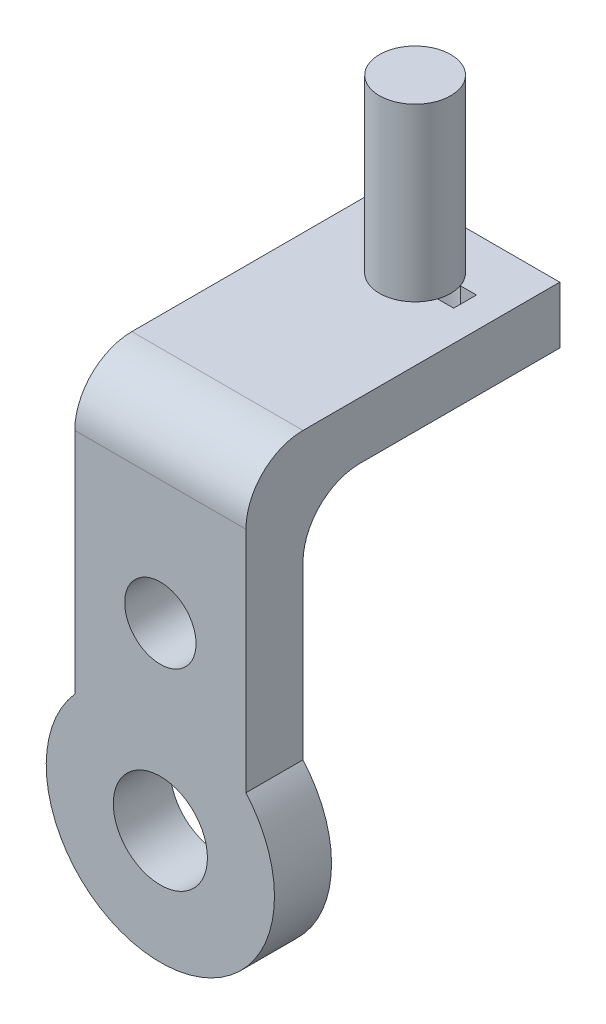
ISO-10303-21;
HEADER;
FILE_DESCRIPTION(('STEP AP214'),'2;1');
FILE_NAME('part.step','',(''),(''),'','','');
FILE_SCHEMA(('AUTOMOTIVE_DESIGN { 1 0 10303 214 1 1 1 1 }'));
ENDSEC;
DATA;
#1=APPLICATION_CONTEXT('core data for automotive mechanical design processes');
#2=APPLICATION_PROTOCOL_DEFINITION('international standard','automotive_design',2000,#1);
#3=PRODUCT_CONTEXT('',#1,'mechanical');
#4=PRODUCT('Part','Part','',(#3));
#5=PRODUCT_RELATED_PRODUCT_CATEGORY('part','',(#4));
#6=PRODUCT_DEFINITION_FORMATION('','',#4);
#7=PRODUCT_DEFINITION_CONTEXT('part definition',#1,'design');
#8=PRODUCT_DEFINITION('design','',#6,#7);
#9=PRODUCT_DEFINITION_SHAPE('','',#8);
#10=(LENGTH_UNIT() NAMED_UNIT(*) SI_UNIT(.MILLI.,.METRE.));
#11=(NAMED_UNIT(*) PLANE_ANGLE_UNIT() SI_UNIT($,.RADIAN.));
#12=(NAMED_UNIT(*) SI_UNIT($,.STERADIAN.) SOLID_ANGLE_UNIT());
#13=UNCERTAINTY_MEASURE_WITH_UNIT(LENGTH_MEASURE(1.E-05),#10,'distance_accuracy_value','');
#14=(GEOMETRIC_REPRESENTATION_CONTEXT(3) GLOBAL_UNCERTAINTY_ASSIGNED_CONTEXT((#13)) GLOBAL_UNIT_ASSIGNED_CONTEXT((#10,
#11,#12)) REPRESENTATION_CONTEXT('',''));
#15=CARTESIAN_POINT('',(0.,0.,0.));
#16=DIRECTION('',(0.,0.,1.));
#17=DIRECTION('',(1.,0.,0.));
#18=AXIS2_PLACEMENT_3D('',#15,#16,#17);
#19=CARTESIAN_POINT('',(5.06055020156282,128.019801980198,-67.5));
#20=DIRECTION('',(0.,-1.,0.));
#21=DIRECTION('',(0.,0.,-1.));
#22=AXIS2_PLACEMENT_3D('',#19,#20,#21);
#23=CYLINDRICAL_SURFACE('',#22,12.5);
#24=CARTESIAN_POINT('',(5.06055020156282,128.019801980198,-67.5));
#25=DIRECTION('',(0.,1.,0.));
#26=DIRECTION('',(0.,0.,1.));
#27=AXIS2_PLACEMENT_3D('',#24,#25,#26);
#28=CIRCLE('',#27,12.5);
#29=CARTESIAN_POINT('',(5.06055020156282,128.019801980198,-55.));
#30=VERTEX_POINT('',#29);
#31=EDGE_CURVE('E11',#30,#30,#28,.T.);
#32=ORIENTED_EDGE('',*,*,#31,.F.);
#33=EDGE_LOOP('',(#32));
#34=FACE_BOUND('',#33,.T.);
#35=CARTESIAN_POINT('',(5.06055020156282,68.0198019801981,-67.5));
#36=DIRECTION('',(0.,1.,0.));
#37=DIRECTION('',(0.,0.,1.));
#38=AXIS2_PLACEMENT_3D('',#35,#36,#37);
#39=CIRCLE('',#38,12.5);
#40=CARTESIAN_POINT('',(5.06055020156282,68.0198019801981,-55.));
#41=VERTEX_POINT('',#40);
#42=EDGE_CURVE('E44',#41,#41,#39,.T.);
#43=ORIENTED_EDGE('',*,*,#42,.T.);
#44=EDGE_LOOP('',(#43));
#45=FACE_BOUND('',#44,.T.);
#46=ADVANCED_FACE('F41',(#34,#45),#23,.T.);
#47=CARTESIAN_POINT('',(5.06055020156282,128.019801980198,-67.5));
#48=DIRECTION('',(0.,1.,0.));
#49=DIRECTION('',(0.,0.,1.));
#50=AXIS2_PLACEMENT_3D('',#47,#48,#49);
#51=PLANE('',#50);
#52=ORIENTED_EDGE('',*,*,#31,.T.);
#53=EDGE_LOOP('',(#52));
#54=FACE_BOUND('',#53,.T.);
#55=ADVANCED_FACE('F56',(#54),#51,.T.);
#56=CARTESIAN_POINT('',(5.06055020156282,68.0198019801981,-67.5));
#57=DIRECTION('',(0.,1.,0.));
#58=DIRECTION('',(0.,0.,1.));
#59=AXIS2_PLACEMENT_3D('',#56,#57,#58);
#60=PLANE('',#59);
#61=ORIENTED_EDGE('',*,*,#42,.F.);
#62=EDGE_LOOP('',(#61));
#63=FACE_BOUND('',#62,.T.);
#64=ADVANCED_FACE('F54',(#63),#60,.F.);
#65=CLOSED_SHELL('',(#46,#55,#64));
#66=MANIFOLD_SOLID_BREP('B2',#65);
#67=CARTESIAN_POINT('',(3.26732673267325,-58.4801980198019,0.));
#68=DIRECTION('',(0.,0.,1.));
#69=DIRECTION('',(1.,0.,0.));
#70=AXIS2_PLACEMENT_3D('',#67,#68,#69);
#71=PLANE('',#70);
#72=CARTESIAN_POINT('',(3.26732673267325,4.51980198019805,0.));
#73=DIRECTION('',(0.,0.,1.));
#74=DIRECTION('',(1.,0.,0.));
#75=AXIS2_PLACEMENT_3D('',#72,#73,#74);
#76=CIRCLE('',#75,12.5);
#77=CARTESIAN_POINT('',(15.7673267326732,4.51980198019805,0.));
#78=VERTEX_POINT('',#77);
#79=EDGE_CURVE('E513',#78,#78,#76,.T.);
#80=ORIENTED_EDGE('',*,*,#79,.T.);
#81=EDGE_LOOP('',(#80));
#82=FACE_BOUND('',#81,.T.);
#83=CARTESIAN_POINT('',(3.26732673267325,-58.4801980198019,0.));
#84=DIRECTION('',(0.,0.,1.));
#85=DIRECTION('',(1.,0.,0.));
#86=AXIS2_PLACEMENT_3D('',#83,#84,#85);
#87=CIRCLE('',#86,16.5);
#88=CARTESIAN_POINT('',(19.7673267326732,-58.4801980198019,0.));
#89=VERTEX_POINT('',#88);
#90=EDGE_CURVE('E228',#89,#89,#87,.T.);
#91=ORIENTED_EDGE('',*,*,#90,.T.);
#92=EDGE_LOOP('',(#91));
#93=FACE_BOUND('',#92,.T.);
#94=DIRECTION('',(0.,-1.,0.));
#95=VECTOR('',#94,1.);
#96=CARTESIAN_POINT('',(-26.7326732673268,68.0198019801981,0.));
#97=LINE('',#96,#95);
#98=CARTESIAN_POINT('',(-26.7326732673268,28.0198019801981,0.));
#99=VERTEX_POINT('',#98);
#100=CARTESIAN_POINT('',(-26.7326732673267,-31.980198019802,0.));
#101=VERTEX_POINT('',#100);
#102=EDGE_CURVE('E232',#99,#101,#97,.T.);
#103=ORIENTED_EDGE('',*,*,#102,.F.);
#104=DIRECTION('',(-1.,0.,0.));
#105=VECTOR('',#104,1.);
#106=CARTESIAN_POINT('',(33.2673267326732,28.0198019801981,0.));
#107=LINE('',#106,#105);
#108=CARTESIAN_POINT('',(33.2673267326732,28.0198019801981,0.));
#109=VERTEX_POINT('',#108);
#110=EDGE_CURVE('E284',#99,#109,#107,.F.);
#111=ORIENTED_EDGE('',*,*,#110,.T.);
#112=DIRECTION('',(0.,1.,0.));
#113=VECTOR('',#112,1.);
#114=CARTESIAN_POINT('',(33.2673267326732,68.0198019801981,0.));
#115=LINE('',#114,#113);
#116=CARTESIAN_POINT('',(33.2673267326733,-31.980198019802,0.));
#117=VERTEX_POINT('',#116);
#118=EDGE_CURVE('E238',#117,#109,#115,.T.);
#119=ORIENTED_EDGE('',*,*,#118,.F.);
#120=DIRECTION('',(1.,1.84921450168608E-13,0.));
#121=VECTOR('',#120,1.);
#122=CARTESIAN_POINT('',(33.2298032658305,-31.980198019802,0.));
#123=LINE('',#122,#121);
#124=CARTESIAN_POINT('',(33.2298032658305,-31.980198019802,0.));
#125=VERTEX_POINT('',#124);
#126=EDGE_CURVE('E253',#125,#117,#123,.T.);
#127=ORIENTED_EDGE('',*,*,#126,.F.);
#128=CARTESIAN_POINT('',(3.26732673267325,-58.4801980198019,0.));
#129=DIRECTION('',(0.,0.,1.));
#130=DIRECTION('',(1.,0.,0.));
#131=AXIS2_PLACEMENT_3D('',#128,#129,#130);
#132=CIRCLE('',#131,40.);
#133=CARTESIAN_POINT('',(-26.695149800484,-31.980198019802,0.));
#134=VERTEX_POINT('',#133);
#135=EDGE_CURVE('E251',#134,#125,#132,.T.);
#136=ORIENTED_EDGE('',*,*,#135,.F.);
#137=DIRECTION('',(1.,-1.84921450168676E-13,0.));
#138=VECTOR('',#137,1.);
#139=CARTESIAN_POINT('',(-26.7326732673267,-31.980198019802,0.));
#140=LINE('',#139,#138);
#141=EDGE_CURVE('E249',#101,#134,#140,.T.);
#142=ORIENTED_EDGE('',*,*,#141,.F.);
#143=EDGE_LOOP('',(#103,#111,#119,#127,#136,#142));
#144=FACE_BOUND('',#143,.T.);
#145=ADVANCED_FACE('F82',(#82,#93,#144),#71,.F.);
#146=CARTESIAN_POINT('',(3.26732673267325,-58.4801980198019,20.));
#147=DIRECTION('',(0.,0.,1.));
#148=DIRECTION('',(1.,0.,0.));
#149=AXIS2_PLACEMENT_3D('',#146,#147,#148);
#150=PLANE('',#149);
#151=CARTESIAN_POINT('',(3.26732673267325,4.51980198019805,20.));
#152=DIRECTION('',(0.,0.,1.));
#153=DIRECTION('',(1.,0.,0.));
#154=AXIS2_PLACEMENT_3D('',#151,#152,#153);
#155=CIRCLE('',#154,12.5);
#156=CARTESIAN_POINT('',(15.7673267326732,4.51980198019805,20.));
#157=VERTEX_POINT('',#156);
#158=EDGE_CURVE('E511',#157,#157,#155,.T.);
#159=ORIENTED_EDGE('',*,*,#158,.F.);
#160=EDGE_LOOP('',(#159));
#161=FACE_BOUND('',#160,.T.);
#162=DIRECTION('',(0.,1.,0.));
#163=VECTOR('',#162,1.);
#164=CARTESIAN_POINT('',(33.2673267326732,68.0198019801981,20.));
#165=LINE('',#164,#163);
#166=CARTESIAN_POINT('',(33.2673267326733,-31.980198019802,20.));
#167=VERTEX_POINT('',#166);
#168=CARTESIAN_POINT('',(33.2673267326732,48.019801980198,20.));
#169=VERTEX_POINT('',#168);
#170=EDGE_CURVE('E244',#167,#169,#165,.T.);
#171=ORIENTED_EDGE('',*,*,#170,.T.);
#172=DIRECTION('',(-1.,0.,0.));
#173=VECTOR('',#172,1.);
#174=CARTESIAN_POINT('',(-26.7326732673268,48.019801980198,20.));
#175=LINE('',#174,#173);
#176=CARTESIAN_POINT('',(-26.7326732673268,48.019801980198,20.));
#177=VERTEX_POINT('',#176);
#178=EDGE_CURVE('E272',#169,#177,#175,.T.);
#179=ORIENTED_EDGE('',*,*,#178,.T.);
#180=DIRECTION('',(0.,-1.,0.));
#181=VECTOR('',#180,1.);
#182=CARTESIAN_POINT('',(-26.7326732673268,68.0198019801981,20.));
#183=LINE('',#182,#181);
#184=CARTESIAN_POINT('',(-26.7326732673267,-31.980198019802,20.));
#185=VERTEX_POINT('',#184);
#186=EDGE_CURVE('E235',#177,#185,#183,.T.);
#187=ORIENTED_EDGE('',*,*,#186,.T.);
#188=DIRECTION('',(1.,-1.84921450168676E-13,0.));
#189=VECTOR('',#188,1.);
#190=CARTESIAN_POINT('',(-26.7326732673267,-31.980198019802,20.));
#191=LINE('',#190,#189);
#192=CARTESIAN_POINT('',(-26.695149800484,-31.980198019802,20.));
#193=VERTEX_POINT('',#192);
#194=EDGE_CURVE('E237',#185,#193,#191,.T.);
#195=ORIENTED_EDGE('',*,*,#194,.T.);
#196=CARTESIAN_POINT('',(3.26732673267325,-58.4801980198019,20.));
#197=DIRECTION('',(0.,0.,1.));
#198=DIRECTION('',(1.,0.,0.));
#199=AXIS2_PLACEMENT_3D('',#196,#197,#198);
#200=CIRCLE('',#199,40.);
#201=CARTESIAN_POINT('',(33.2298032658305,-31.980198019802,20.));
#202=VERTEX_POINT('',#201);
#203=EDGE_CURVE('E240',#193,#202,#200,.T.);
#204=ORIENTED_EDGE('',*,*,#203,.T.);
#205=DIRECTION('',(1.,1.84921450168608E-13,0.));
#206=VECTOR('',#205,1.);
#207=CARTESIAN_POINT('',(33.2298032658305,-31.980198019802,20.));
#208=LINE('',#207,#206);
#209=EDGE_CURVE('E242',#202,#167,#208,.T.);
#210=ORIENTED_EDGE('',*,*,#209,.T.);
#211=EDGE_LOOP('',(#171,#179,#187,#195,#204,#210));
#212=FACE_BOUND('',#211,.T.);
#213=CARTESIAN_POINT('',(3.26732673267325,-58.4801980198019,20.));
#214=DIRECTION('',(0.,0.,1.));
#215=DIRECTION('',(1.,0.,0.));
#216=AXIS2_PLACEMENT_3D('',#213,#214,#215);
#217=CIRCLE('',#216,16.5);
#218=CARTESIAN_POINT('',(19.7673267326732,-58.4801980198019,20.));
#219=VERTEX_POINT('',#218);
#220=EDGE_CURVE('E229',#219,#219,#217,.T.);
#221=ORIENTED_EDGE('',*,*,#220,.F.);
#222=EDGE_LOOP('',(#221));
#223=FACE_BOUND('',#222,.T.);
#224=ADVANCED_FACE('F312',(#161,#212,#223),#150,.T.);
#225=CARTESIAN_POINT('',(-26.7326732673268,68.0198019801981,20.));
#226=DIRECTION('',(1.,0.,0.));
#227=DIRECTION('',(0.,1.,0.));
#228=AXIS2_PLACEMENT_3D('',#225,#226,#227);
#229=PLANE('',#228);
#230=ORIENTED_EDGE('',*,*,#186,.F.);
#231=CARTESIAN_POINT('',(-26.7326732673268,48.019801980198,0.));
#232=DIRECTION('',(1.,0.,0.));
#233=DIRECTION('',(0.,1.,0.));
#234=AXIS2_PLACEMENT_3D('',#231,#232,#233);
#235=CIRCLE('',#234,20.);
#236=CARTESIAN_POINT('',(-26.7326732673268,68.0198019801981,0.));
#237=VERTEX_POINT('',#236);
#238=EDGE_CURVE('E275',#177,#237,#235,.F.);
#239=ORIENTED_EDGE('',*,*,#238,.T.);
#240=DIRECTION('',(0.,0.,-1.));
#241=VECTOR('',#240,1.);
#242=CARTESIAN_POINT('',(-26.7326732673268,68.0198019801981,20.));
#243=LINE('',#242,#241);
#244=CARTESIAN_POINT('',(-26.7326732673268,68.0198019801981,-90.));
#245=VERTEX_POINT('',#244);
#246=EDGE_CURVE('E247',#237,#245,#243,.T.);
#247=ORIENTED_EDGE('',*,*,#246,.T.);
#248=DIRECTION('',(0.,1.,0.));
#249=VECTOR('',#248,1.);
#250=CARTESIAN_POINT('',(-26.7326732673268,68.0198019801981,-90.));
#251=LINE('',#250,#249);
#252=CARTESIAN_POINT('',(-26.7326732673268,48.019801980198,-90.));
#253=VERTEX_POINT('',#252);
#254=EDGE_CURVE('E216',#253,#245,#251,.T.);
#255=ORIENTED_EDGE('',*,*,#254,.F.);
#256=DIRECTION('',(0.,0.,1.));
#257=VECTOR('',#256,1.);
#258=CARTESIAN_POINT('',(-26.7326732673268,48.019801980198,-90.));
#259=LINE('',#258,#257);
#260=CARTESIAN_POINT('',(-26.7326732673268,48.019801980198,-20.));
#261=VERTEX_POINT('',#260);
#262=EDGE_CURVE('E222',#253,#261,#259,.T.);
#263=ORIENTED_EDGE('',*,*,#262,.T.);
#264=CARTESIAN_POINT('',(-26.7326732673268,28.0198019801981,-20.));
#265=DIRECTION('',(1.,0.,0.));
#266=DIRECTION('',(0.,1.,0.));
#267=AXIS2_PLACEMENT_3D('',#264,#265,#266);
#268=CIRCLE('',#267,20.);
#269=EDGE_CURVE('E286',#261,#99,#268,.T.);
#270=ORIENTED_EDGE('',*,*,#269,.T.);
#271=ORIENTED_EDGE('',*,*,#102,.T.);
#272=DIRECTION('',(0.,0.,-1.));
#273=VECTOR('',#272,1.);
#274=CARTESIAN_POINT('',(-26.7326732673267,-31.980198019802,20.));
#275=LINE('',#274,#273);
#276=EDGE_CURVE('E269',#185,#101,#275,.T.);
#277=ORIENTED_EDGE('',*,*,#276,.F.);
#278=EDGE_LOOP('',(#230,#239,#247,#255,#263,#270,#271,#277));
#279=FACE_BOUND('',#278,.T.);
#280=ADVANCED_FACE('F318',(#279),#229,.F.);
#281=CARTESIAN_POINT('',(-26.7326732673267,-31.980198019802,20.));
#282=DIRECTION('',(1.84921450168676E-13,1.,0.));
#283=DIRECTION('',(-1.,1.84921450168676E-13,0.));
#284=AXIS2_PLACEMENT_3D('',#281,#282,#283);
#285=PLANE('',#284);
#286=ORIENTED_EDGE('',*,*,#141,.T.);
#287=DIRECTION('',(0.,0.,-1.));
#288=VECTOR('',#287,1.);
#289=CARTESIAN_POINT('',(-26.695149800484,-31.980198019802,20.));
#290=LINE('',#289,#288);
#291=EDGE_CURVE('E266',#193,#134,#290,.T.);
#292=ORIENTED_EDGE('',*,*,#291,.F.);
#293=ORIENTED_EDGE('',*,*,#194,.F.);
#294=ORIENTED_EDGE('',*,*,#276,.T.);
#295=EDGE_LOOP('',(#286,#292,#293,#294));
#296=FACE_BOUND('',#295,.T.);
#297=ADVANCED_FACE('F339',(#296),#285,.F.);
#298=CARTESIAN_POINT('',(3.26732673267325,-58.4801980198019,20.));
#299=DIRECTION('',(0.,0.,-1.));
#300=DIRECTION('',(-1.,0.,0.));
#301=AXIS2_PLACEMENT_3D('',#298,#299,#300);
#302=CYLINDRICAL_SURFACE('',#301,40.);
#303=ORIENTED_EDGE('',*,*,#135,.T.);
#304=DIRECTION('',(0.,0.,-1.));
#305=VECTOR('',#304,1.);
#306=CARTESIAN_POINT('',(33.2298032658305,-31.980198019802,20.));
#307=LINE('',#306,#305);
#308=EDGE_CURVE('E263',#202,#125,#307,.T.);
#309=ORIENTED_EDGE('',*,*,#308,.F.);
#310=ORIENTED_EDGE('',*,*,#203,.F.);
#311=ORIENTED_EDGE('',*,*,#291,.T.);
#312=EDGE_LOOP('',(#303,#309,#310,#311));
#313=FACE_BOUND('',#312,.T.);
#314=ADVANCED_FACE('F335',(#313),#302,.T.);
#315=CARTESIAN_POINT('',(33.2298032658305,-31.980198019802,20.));
#316=DIRECTION('',(-1.84921450168608E-13,1.,0.));
#317=DIRECTION('',(-1.,-1.84921450168608E-13,0.));
#318=AXIS2_PLACEMENT_3D('',#315,#316,#317);
#319=PLANE('',#318);
#320=ORIENTED_EDGE('',*,*,#126,.T.);
#321=DIRECTION('',(0.,0.,-1.));
#322=VECTOR('',#321,1.);
#323=CARTESIAN_POINT('',(33.2673267326733,-31.980198019802,20.));
#324=LINE('',#323,#322);
#325=EDGE_CURVE('E260',#167,#117,#324,.T.);
#326=ORIENTED_EDGE('',*,*,#325,.F.);
#327=ORIENTED_EDGE('',*,*,#209,.F.);
#328=ORIENTED_EDGE('',*,*,#308,.T.);
#329=EDGE_LOOP('',(#320,#326,#327,#328));
#330=FACE_BOUND('',#329,.T.);
#331=ADVANCED_FACE('F331',(#330),#319,.F.);
#332=CARTESIAN_POINT('',(33.2673267326732,68.0198019801981,20.));
#333=DIRECTION('',(-1.,0.,0.));
#334=DIRECTION('',(0.,-1.,0.));
#335=AXIS2_PLACEMENT_3D('',#332,#333,#334);
#336=PLANE('',#335);
#337=DIRECTION('',(0.,0.,-1.));
#338=VECTOR('',#337,1.);
#339=CARTESIAN_POINT('',(33.2673267326732,68.0198019801981,20.));
#340=LINE('',#339,#338);
#341=CARTESIAN_POINT('',(33.2673267326732,68.0198019801981,0.));
#342=VERTEX_POINT('',#341);
#343=CARTESIAN_POINT('',(33.2673267326732,68.0198019801981,-90.));
#344=VERTEX_POINT('',#343);
#345=EDGE_CURVE('E258',#342,#344,#340,.T.);
#346=ORIENTED_EDGE('',*,*,#345,.F.);
#347=CARTESIAN_POINT('',(33.2673267326732,48.019801980198,0.));
#348=DIRECTION('',(-1.,0.,0.));
#349=DIRECTION('',(0.,-1.,0.));
#350=AXIS2_PLACEMENT_3D('',#347,#348,#349);
#351=CIRCLE('',#350,20.);
#352=EDGE_CURVE('E279',#342,#169,#351,.F.);
#353=ORIENTED_EDGE('',*,*,#352,.T.);
#354=ORIENTED_EDGE('',*,*,#170,.F.);
#355=ORIENTED_EDGE('',*,*,#325,.T.);
#356=ORIENTED_EDGE('',*,*,#118,.T.);
#357=CARTESIAN_POINT('',(33.2673267326732,28.0198019801981,-20.));
#358=DIRECTION('',(-1.,0.,0.));
#359=DIRECTION('',(0.,-1.,0.));
#360=AXIS2_PLACEMENT_3D('',#357,#358,#359);
#361=CIRCLE('',#360,20.);
#362=CARTESIAN_POINT('',(33.2673267326732,48.019801980198,-20.));
#363=VERTEX_POINT('',#362);
#364=EDGE_CURVE('E288',#109,#363,#361,.T.);
#365=ORIENTED_EDGE('',*,*,#364,.T.);
#366=DIRECTION('',(0.,0.,1.));
#367=VECTOR('',#366,1.);
#368=CARTESIAN_POINT('',(33.2673267326732,48.019801980198,-90.));
#369=LINE('',#368,#367);
#370=CARTESIAN_POINT('',(33.2673267326732,48.019801980198,-90.));
#371=VERTEX_POINT('',#370);
#372=EDGE_CURVE('E225',#371,#363,#369,.T.);
#373=ORIENTED_EDGE('',*,*,#372,.F.);
#374=DIRECTION('',(0.,-1.,0.));
#375=VECTOR('',#374,1.);
#376=CARTESIAN_POINT('',(33.2673267326732,68.0198019801981,-90.));
#377=LINE('',#376,#375);
#378=EDGE_CURVE('E209',#344,#371,#377,.T.);
#379=ORIENTED_EDGE('',*,*,#378,.F.);
#380=EDGE_LOOP('',(#346,#353,#354,#355,#356,#365,#373,#379));
#381=FACE_BOUND('',#380,.T.);
#382=ADVANCED_FACE('F328',(#381),#336,.F.);
#383=CARTESIAN_POINT('',(-26.7326732673268,68.0198019801981,20.));
#384=DIRECTION('',(0.,-1.,0.));
#385=DIRECTION('',(0.,0.,-1.));
#386=AXIS2_PLACEMENT_3D('',#383,#384,#385);
#387=PLANE('',#386);
#388=DIRECTION('',(-1.,0.,0.));
#389=VECTOR('',#388,1.);
#390=CARTESIAN_POINT('',(16.9032694838898,68.0198019801981,-71.5));
#391=LINE('',#390,#389);
#392=CARTESIAN_POINT('',(22.5605502015628,68.0198019801981,-71.5));
#393=VERTEX_POINT('',#392);
#394=CARTESIAN_POINT('',(16.9032694838898,68.0198019801981,-71.5));
#395=VERTEX_POINT('',#394);
#396=EDGE_CURVE('E195',#393,#395,#391,.T.);
#397=ORIENTED_EDGE('',*,*,#396,.F.);
#398=DIRECTION('',(0.,0.,-1.));
#399=VECTOR('',#398,1.);
#400=CARTESIAN_POINT('',(22.5605502015628,68.0198019801981,-71.5));
#401=LINE('',#400,#399);
#402=CARTESIAN_POINT('',(22.5605502015628,68.0198019801981,-63.5));
#403=VERTEX_POINT('',#402);
#404=EDGE_CURVE('E97',#403,#393,#401,.T.);
#405=ORIENTED_EDGE('',*,*,#404,.F.);
#406=DIRECTION('',(1.,0.,0.));
#407=VECTOR('',#406,1.);
#408=CARTESIAN_POINT('',(16.9032694838898,68.0198019801981,-63.5));
#409=LINE('',#408,#407);
#410=CARTESIAN_POINT('',(16.9032694838898,68.0198019801981,-63.5));
#411=VERTEX_POINT('',#410);
#412=EDGE_CURVE('E202',#411,#403,#409,.T.);
#413=ORIENTED_EDGE('',*,*,#412,.F.);
#414=CARTESIAN_POINT('',(5.06055020156282,68.0198019801981,-67.5));
#415=DIRECTION('',(0.,1.,0.));
#416=DIRECTION('',(0.,0.,1.));
#417=AXIS2_PLACEMENT_3D('',#414,#415,#416);
#418=CIRCLE('',#417,12.5);
#419=EDGE_CURVE('E186',#395,#411,#418,.T.);
#420=ORIENTED_EDGE('',*,*,#419,.F.);
#421=EDGE_LOOP('',(#397,#405,#413,#420));
#422=FACE_BOUND('',#421,.T.);
#423=ORIENTED_EDGE('',*,*,#246,.F.);
#424=DIRECTION('',(-1.,0.,0.));
#425=VECTOR('',#424,1.);
#426=CARTESIAN_POINT('',(33.2673267326732,68.0198019801981,0.));
#427=LINE('',#426,#425);
#428=EDGE_CURVE('E277',#237,#342,#427,.F.);
#429=ORIENTED_EDGE('',*,*,#428,.T.);
#430=ORIENTED_EDGE('',*,*,#345,.T.);
#431=DIRECTION('',(1.,0.,0.));
#432=VECTOR('',#431,1.);
#433=CARTESIAN_POINT('',(33.2673267326732,68.0198019801981,-90.));
#434=LINE('',#433,#432);
#435=EDGE_CURVE('E219',#245,#344,#434,.T.);
#436=ORIENTED_EDGE('',*,*,#435,.F.);
#437=EDGE_LOOP('',(#423,#429,#430,#436));
#438=FACE_BOUND('',#437,.T.);
#439=ADVANCED_FACE('F199',(#422,#438),#387,.F.);
#440=CARTESIAN_POINT('',(3.26732673267325,-58.4801980198019,20.));
#441=DIRECTION('',(0.,0.,-1.));
#442=DIRECTION('',(-1.,0.,0.));
#443=AXIS2_PLACEMENT_3D('',#440,#441,#442);
#444=CYLINDRICAL_SURFACE('',#443,16.5);
#445=ORIENTED_EDGE('',*,*,#220,.T.);
#446=EDGE_LOOP('',(#445));
#447=FACE_BOUND('',#446,.T.);
#448=ORIENTED_EDGE('',*,*,#90,.F.);
#449=EDGE_LOOP('',(#448));
#450=FACE_BOUND('',#449,.T.);
#451=ADVANCED_FACE('F327',(#447,#450),#444,.F.);
#452=CARTESIAN_POINT('',(33.2673267326732,48.019801980198,-90.));
#453=DIRECTION('',(0.,1.,0.));
#454=DIRECTION('',(0.,0.,1.));
#455=AXIS2_PLACEMENT_3D('',#452,#453,#454);
#456=PLANE('',#455);
#457=DIRECTION('',(1.,0.,0.));
#458=VECTOR('',#457,1.);
#459=CARTESIAN_POINT('',(33.2673267326732,48.019801980198,-63.5));
#460=LINE('',#459,#458);
#461=CARTESIAN_POINT('',(16.9032694838898,48.0198019801981,-63.5));
#462=VERTEX_POINT('',#461);
#463=CARTESIAN_POINT('',(22.5605502015628,48.0198019801981,-63.5));
#464=VERTEX_POINT('',#463);
#465=EDGE_CURVE('E90',#462,#464,#460,.T.);
#466=ORIENTED_EDGE('',*,*,#465,.T.);
#467=DIRECTION('',(0.,0.,-1.));
#468=VECTOR('',#467,1.);
#469=CARTESIAN_POINT('',(22.5605502015628,48.019801980198,-90.));
#470=LINE('',#469,#468);
#471=CARTESIAN_POINT('',(22.5605502015628,48.0198019801981,-71.5));
#472=VERTEX_POINT('',#471);
#473=EDGE_CURVE('E39',#464,#472,#470,.T.);
#474=ORIENTED_EDGE('',*,*,#473,.T.);
#475=DIRECTION('',(-1.,0.,0.));
#476=VECTOR('',#475,1.);
#477=CARTESIAN_POINT('',(33.2673267326732,48.019801980198,-71.5));
#478=LINE('',#477,#476);
#479=CARTESIAN_POINT('',(16.9032694838898,48.019801980198,-71.5));
#480=VERTEX_POINT('',#479);
#481=EDGE_CURVE('E290',#472,#480,#478,.T.);
#482=ORIENTED_EDGE('',*,*,#481,.T.);
#483=CARTESIAN_POINT('',(5.06055020156282,48.0198019801981,-67.5));
#484=DIRECTION('',(0.,1.,0.));
#485=DIRECTION('',(0.,0.,1.));
#486=AXIS2_PLACEMENT_3D('',#483,#484,#485);
#487=CIRCLE('',#486,12.5);
#488=EDGE_CURVE('E189',#480,#462,#487,.T.);
#489=ORIENTED_EDGE('',*,*,#488,.T.);
#490=EDGE_LOOP('',(#466,#474,#482,#489));
#491=FACE_BOUND('',#490,.T.);
#492=ORIENTED_EDGE('',*,*,#372,.T.);
#493=DIRECTION('',(-1.,0.,0.));
#494=VECTOR('',#493,1.);
#495=CARTESIAN_POINT('',(-26.7326732673268,48.019801980198,-20.));
#496=LINE('',#495,#494);
#497=EDGE_CURVE('E281',#363,#261,#496,.T.);
#498=ORIENTED_EDGE('',*,*,#497,.T.);
#499=ORIENTED_EDGE('',*,*,#262,.F.);
#500=DIRECTION('',(-1.,0.,0.));
#501=VECTOR('',#500,1.);
#502=CARTESIAN_POINT('',(33.2673267326732,48.019801980198,-90.));
#503=LINE('',#502,#501);
#504=EDGE_CURVE('E214',#371,#253,#503,.T.);
#505=ORIENTED_EDGE('',*,*,#504,.F.);
#506=EDGE_LOOP('',(#492,#498,#499,#505));
#507=FACE_BOUND('',#506,.T.);
#508=ADVANCED_FACE('F294',(#491,#507),#456,.F.);
#509=CARTESIAN_POINT('',(0.,0.,-90.));
#510=DIRECTION('',(0.,0.,-1.));
#511=DIRECTION('',(-1.,0.,0.));
#512=AXIS2_PLACEMENT_3D('',#509,#510,#511);
#513=PLANE('',#512);
#514=ORIENTED_EDGE('',*,*,#378,.T.);
#515=ORIENTED_EDGE('',*,*,#504,.T.);
#516=ORIENTED_EDGE('',*,*,#254,.T.);
#517=ORIENTED_EDGE('',*,*,#435,.T.);
#518=EDGE_LOOP('',(#514,#515,#516,#517));
#519=FACE_BOUND('',#518,.T.);
#520=ADVANCED_FACE('F347',(#519),#513,.T.);
#521=CARTESIAN_POINT('',(3.26732673267325,48.019801980198,0.));
#522=DIRECTION('',(1.,0.,0.));
#523=DIRECTION('',(0.,0.,-1.));
#524=AXIS2_PLACEMENT_3D('',#521,#522,#523);
#525=CYLINDRICAL_SURFACE('',#524,20.);
#526=ORIENTED_EDGE('',*,*,#352,.F.);
#527=ORIENTED_EDGE('',*,*,#428,.F.);
#528=ORIENTED_EDGE('',*,*,#238,.F.);
#529=ORIENTED_EDGE('',*,*,#178,.F.);
#530=EDGE_LOOP('',(#526,#527,#528,#529));
#531=FACE_BOUND('',#530,.T.);
#532=ADVANCED_FACE('F307',(#531),#525,.T.);
#533=CARTESIAN_POINT('',(33.2673267326732,28.0198019801981,-20.));
#534=DIRECTION('',(1.,0.,0.));
#535=DIRECTION('',(0.,0.,-1.));
#536=AXIS2_PLACEMENT_3D('',#533,#534,#535);
#537=CYLINDRICAL_SURFACE('',#536,20.);
#538=ORIENTED_EDGE('',*,*,#364,.F.);
#539=ORIENTED_EDGE('',*,*,#110,.F.);
#540=ORIENTED_EDGE('',*,*,#269,.F.);
#541=ORIENTED_EDGE('',*,*,#497,.F.);
#542=EDGE_LOOP('',(#538,#539,#540,#541));
#543=FACE_BOUND('',#542,.T.);
#544=ADVANCED_FACE('F84',(#543),#537,.F.);
#545=CARTESIAN_POINT('',(22.5605502015628,-98.480198019802,-71.5));
#546=DIRECTION('',(1.,0.,0.));
#547=DIRECTION('',(0.,0.,-1.));
#548=AXIS2_PLACEMENT_3D('',#545,#546,#547);
#549=PLANE('',#548);
#550=DIRECTION('',(0.,1.,0.));
#551=VECTOR('',#550,1.);
#552=CARTESIAN_POINT('',(22.5605502015628,-98.480198019802,-63.5));
#553=LINE('',#552,#551);
#554=EDGE_CURVE('E207',#464,#403,#553,.T.);
#555=ORIENTED_EDGE('',*,*,#554,.T.);
#556=ORIENTED_EDGE('',*,*,#404,.T.);
#557=DIRECTION('',(0.,1.,0.));
#558=VECTOR('',#557,1.);
#559=CARTESIAN_POINT('',(22.5605502015628,-98.480198019802,-71.5));
#560=LINE('',#559,#558);
#561=EDGE_CURVE('E192',#472,#393,#560,.T.);
#562=ORIENTED_EDGE('',*,*,#561,.F.);
#563=ORIENTED_EDGE('',*,*,#473,.F.);
#564=EDGE_LOOP('',(#555,#556,#562,#563));
#565=FACE_BOUND('',#564,.T.);
#566=ADVANCED_FACE('F299',(#565),#549,.F.);
#567=CARTESIAN_POINT('',(16.9032694838898,-98.480198019802,-63.5));
#568=DIRECTION('',(0.,0.,1.));
#569=DIRECTION('',(1.,0.,0.));
#570=AXIS2_PLACEMENT_3D('',#567,#568,#569);
#571=PLANE('',#570);
#572=DIRECTION('',(0.,1.,0.));
#573=VECTOR('',#572,1.);
#574=CARTESIAN_POINT('',(16.9032694838898,-98.480198019802,-63.5));
#575=LINE('',#574,#573);
#576=EDGE_CURVE('E191',#462,#411,#575,.T.);
#577=ORIENTED_EDGE('',*,*,#576,.T.);
#578=ORIENTED_EDGE('',*,*,#412,.T.);
#579=ORIENTED_EDGE('',*,*,#554,.F.);
#580=ORIENTED_EDGE('',*,*,#465,.F.);
#581=EDGE_LOOP('',(#577,#578,#579,#580));
#582=FACE_BOUND('',#581,.T.);
#583=ADVANCED_FACE('F298',(#582),#571,.F.);
#584=CARTESIAN_POINT('',(5.06055020156282,-98.480198019802,-67.5));
#585=DIRECTION('',(0.,1.,0.));
#586=DIRECTION('',(0.,0.,1.));
#587=AXIS2_PLACEMENT_3D('',#584,#585,#586);
#588=CYLINDRICAL_SURFACE('',#587,12.5);
#589=DIRECTION('',(0.,1.,0.));
#590=VECTOR('',#589,1.);
#591=CARTESIAN_POINT('',(16.9032694838898,-98.480198019802,-71.5));
#592=LINE('',#591,#590);
#593=EDGE_CURVE('E105',#480,#395,#592,.T.);
#594=ORIENTED_EDGE('',*,*,#593,.T.);
#595=ORIENTED_EDGE('',*,*,#419,.T.);
#596=ORIENTED_EDGE('',*,*,#576,.F.);
#597=ORIENTED_EDGE('',*,*,#488,.F.);
#598=EDGE_LOOP('',(#594,#595,#596,#597));
#599=FACE_BOUND('',#598,.T.);
#600=ADVANCED_FACE('F183',(#599),#588,.F.);
#601=CARTESIAN_POINT('',(16.9032694838898,-98.480198019802,-71.5));
#602=DIRECTION('',(0.,0.,-1.));
#603=DIRECTION('',(-1.,0.,0.));
#604=AXIS2_PLACEMENT_3D('',#601,#602,#603);
#605=PLANE('',#604);
#606=ORIENTED_EDGE('',*,*,#561,.T.);
#607=ORIENTED_EDGE('',*,*,#396,.T.);
#608=ORIENTED_EDGE('',*,*,#593,.F.);
#609=ORIENTED_EDGE('',*,*,#481,.F.);
#610=EDGE_LOOP('',(#606,#607,#608,#609));
#611=FACE_BOUND('',#610,.T.);
#612=ADVANCED_FACE('F196',(#611),#605,.F.);
#613=CARTESIAN_POINT('',(3.26732673267325,4.51980198019805,-5.));
#614=DIRECTION('',(0.,0.,1.));
#615=DIRECTION('',(1.,0.,0.));
#616=AXIS2_PLACEMENT_3D('',#613,#614,#615);
#617=CYLINDRICAL_SURFACE('',#616,12.5);
#618=ORIENTED_EDGE('',*,*,#158,.T.);
#619=EDGE_LOOP('',(#618));
#620=FACE_BOUND('',#619,.T.);
#621=ORIENTED_EDGE('',*,*,#79,.F.);
#622=EDGE_LOOP('',(#621));
#623=FACE_BOUND('',#622,.T.);
#624=ADVANCED_FACE('F433',(#620,#623),#617,.F.);
#625=CLOSED_SHELL('',(#145,#224,#280,#297,#314,#331,#382,#439,#451,#508,#520,#532,#544,#566,
#583,#600,#612,#624));
#626=MANIFOLD_SOLID_BREP('B6',#625);
#627=ADVANCED_BREP_SHAPE_REPRESENTATION('',(#18,#66,#626),#14);
#628=SHAPE_DEFINITION_REPRESENTATION(#9,#627);
ENDSEC;
END-ISO-10303-21;
